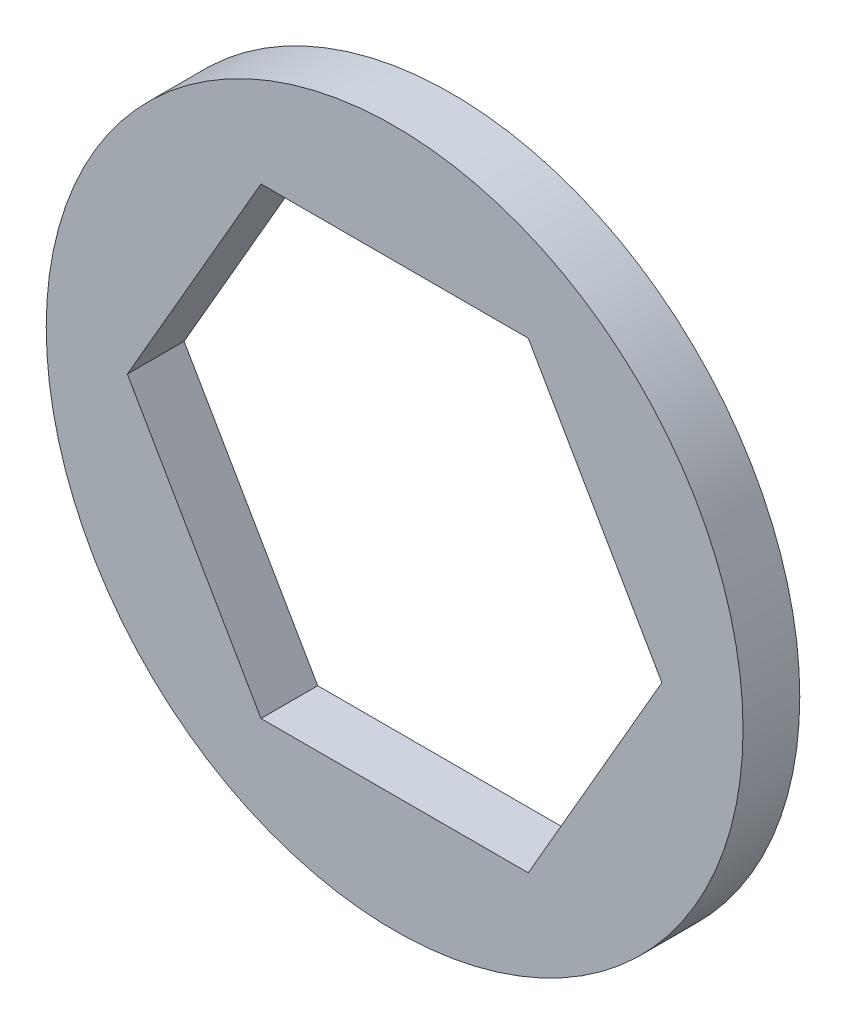
ISO-10303-21;
HEADER;
FILE_DESCRIPTION(('STEP AP214'),'2;1');
FILE_NAME('part.step','',(''),(''),'','','');
FILE_SCHEMA(('AUTOMOTIVE_DESIGN { 1 0 10303 214 1 1 1 1 }'));
ENDSEC;
DATA;
#1=APPLICATION_CONTEXT('core data for automotive mechanical design processes');
#2=APPLICATION_PROTOCOL_DEFINITION('international standard','automotive_design',2000,#1);
#3=PRODUCT_CONTEXT('',#1,'mechanical');
#4=PRODUCT('Part','Part','',(#3));
#5=PRODUCT_RELATED_PRODUCT_CATEGORY('part','',(#4));
#6=PRODUCT_DEFINITION_FORMATION('','',#4);
#7=PRODUCT_DEFINITION_CONTEXT('part definition',#1,'design');
#8=PRODUCT_DEFINITION('design','',#6,#7);
#9=PRODUCT_DEFINITION_SHAPE('','',#8);
#10=(LENGTH_UNIT() NAMED_UNIT(*) SI_UNIT(.MILLI.,.METRE.));
#11=(NAMED_UNIT(*) PLANE_ANGLE_UNIT() SI_UNIT($,.RADIAN.));
#12=(NAMED_UNIT(*) SI_UNIT($,.STERADIAN.) SOLID_ANGLE_UNIT());
#13=UNCERTAINTY_MEASURE_WITH_UNIT(LENGTH_MEASURE(1.E-05),#10,'distance_accuracy_value','');
#14=(GEOMETRIC_REPRESENTATION_CONTEXT(3) GLOBAL_UNCERTAINTY_ASSIGNED_CONTEXT((#13)) GLOBAL_UNIT_ASSIGNED_CONTEXT((#10,
#11,#12)) REPRESENTATION_CONTEXT('',''));
#15=CARTESIAN_POINT('',(0.,0.,0.));
#16=DIRECTION('',(0.,0.,1.));
#17=DIRECTION('',(1.,0.,0.));
#18=AXIS2_PLACEMENT_3D('',#15,#16,#17);
#19=CARTESIAN_POINT('',(0.,0.,0.79375));
#20=DIRECTION('',(0.,0.,1.));
#21=DIRECTION('',(1.,0.,0.));
#22=AXIS2_PLACEMENT_3D('',#19,#20,#21);
#23=PLANE('',#22);
#24=DIRECTION('',(1.,0.,0.));
#25=VECTOR('',#24,1.);
#26=CARTESIAN_POINT('',(3.7394976935412,6.477,0.79375));
#27=LINE('',#26,#25);
#28=CARTESIAN_POINT('',(3.7394976935412,6.477,0.79375));
#29=VERTEX_POINT('',#28);
#30=CARTESIAN_POINT('',(-3.73949769354121,6.477,0.79375));
#31=VERTEX_POINT('',#30);
#32=EDGE_CURVE('E64',#29,#31,#27,.F.);
#33=ORIENTED_EDGE('',*,*,#32,.F.);
#34=DIRECTION('',(0.5,-0.866025403784439,0.));
#35=VECTOR('',#34,1.);
#36=CARTESIAN_POINT('',(7.47899538708241,0.,0.79375));
#37=LINE('',#36,#35);
#38=CARTESIAN_POINT('',(7.47899538708242,0.,0.79375));
#39=VERTEX_POINT('',#38);
#40=EDGE_CURVE('E112',#39,#29,#37,.F.);
#41=ORIENTED_EDGE('',*,*,#40,.F.);
#42=DIRECTION('',(-0.5,-0.866025403784439,0.));
#43=VECTOR('',#42,1.);
#44=CARTESIAN_POINT('',(3.73949769354121,-6.477,0.79375));
#45=LINE('',#44,#43);
#46=CARTESIAN_POINT('',(3.73949769354121,-6.477,0.79375));
#47=VERTEX_POINT('',#46);
#48=EDGE_CURVE('E108',#47,#39,#45,.F.);
#49=ORIENTED_EDGE('',*,*,#48,.F.);
#50=DIRECTION('',(1.,0.,0.));
#51=VECTOR('',#50,1.);
#52=CARTESIAN_POINT('',(-3.73949769354121,-6.477,0.79375));
#53=LINE('',#52,#51);
#54=CARTESIAN_POINT('',(-3.73949769354121,-6.477,0.79375));
#55=VERTEX_POINT('',#54);
#56=EDGE_CURVE('E83',#55,#47,#53,.T.);
#57=ORIENTED_EDGE('',*,*,#56,.F.);
#58=DIRECTION('',(-0.5,0.866025403784439,0.));
#59=VECTOR('',#58,1.);
#60=CARTESIAN_POINT('',(-7.47899538708241,0.,0.79375));
#61=LINE('',#60,#59);
#62=CARTESIAN_POINT('',(-7.47899538708241,0.,0.79375));
#63=VERTEX_POINT('',#62);
#64=EDGE_CURVE('E78',#63,#55,#61,.F.);
#65=ORIENTED_EDGE('',*,*,#64,.F.);
#66=DIRECTION('',(0.5,0.866025403784439,0.));
#67=VECTOR('',#66,1.);
#68=CARTESIAN_POINT('',(-3.73949769354121,6.477,0.79375));
#69=LINE('',#68,#67);
#70=EDGE_CURVE('E69',#31,#63,#69,.F.);
#71=ORIENTED_EDGE('',*,*,#70,.F.);
#72=EDGE_LOOP('',(#33,#41,#49,#57,#65,#71));
#73=FACE_BOUND('',#72,.T.);
#74=CARTESIAN_POINT('',(0.,0.,0.79375));
#75=DIRECTION('',(0.,0.,-1.));
#76=DIRECTION('',(-1.,0.,0.));
#77=AXIS2_PLACEMENT_3D('',#74,#75,#76);
#78=CIRCLE('',#77,9.75);
#79=CARTESIAN_POINT('',(-9.75,0.,0.79375));
#80=VERTEX_POINT('',#79);
#81=EDGE_CURVE('E18',#80,#80,#78,.T.);
#82=ORIENTED_EDGE('',*,*,#81,.F.);
#83=EDGE_LOOP('',(#82));
#84=FACE_BOUND('',#83,.T.);
#85=ADVANCED_FACE('F15',(#73,#84),#23,.T.);
#86=CARTESIAN_POINT('',(0.,0.,0.79375));
#87=DIRECTION('',(0.,0.,-1.));
#88=DIRECTION('',(-1.,0.,0.));
#89=AXIS2_PLACEMENT_3D('',#86,#87,#88);
#90=CYLINDRICAL_SURFACE('',#89,9.75);
#91=ORIENTED_EDGE('',*,*,#81,.T.);
#92=EDGE_LOOP('',(#91));
#93=FACE_BOUND('',#92,.T.);
#94=CARTESIAN_POINT('',(0.,0.,-0.79375));
#95=DIRECTION('',(0.,0.,-1.));
#96=DIRECTION('',(-1.,0.,0.));
#97=AXIS2_PLACEMENT_3D('',#94,#95,#96);
#98=CIRCLE('',#97,9.75);
#99=CARTESIAN_POINT('',(-9.75,0.,-0.79375));
#100=VERTEX_POINT('',#99);
#101=EDGE_CURVE('E94',#100,#100,#98,.F.);
#102=ORIENTED_EDGE('',*,*,#101,.T.);
#103=EDGE_LOOP('',(#102));
#104=FACE_BOUND('',#103,.T.);
#105=ADVANCED_FACE('F183',(#93,#104),#90,.T.);
#106=CARTESIAN_POINT('',(-7.47899538708241,0.,0.79375));
#107=DIRECTION('',(0.866025403784439,0.5,0.));
#108=DIRECTION('',(-0.5,0.866025403784439,0.));
#109=AXIS2_PLACEMENT_3D('',#106,#107,#108);
#110=PLANE('',#109);
#111=ORIENTED_EDGE('',*,*,#64,.T.);
#112=DIRECTION('',(0.,0.,1.));
#113=VECTOR('',#112,1.);
#114=CARTESIAN_POINT('',(-3.73949769354121,-6.477,0.79375));
#115=LINE('',#114,#113);
#116=CARTESIAN_POINT('',(-3.73949769354121,-6.477,-0.79375));
#117=VERTEX_POINT('',#116);
#118=EDGE_CURVE('E101',#117,#55,#115,.T.);
#119=ORIENTED_EDGE('',*,*,#118,.F.);
#120=DIRECTION('',(-0.5,0.866025403784439,0.));
#121=VECTOR('',#120,1.);
#122=CARTESIAN_POINT('',(-3.73949769354121,-6.477,-0.79375));
#123=LINE('',#122,#121);
#124=CARTESIAN_POINT('',(-7.47899538708241,0.,-0.79375));
#125=VERTEX_POINT('',#124);
#126=EDGE_CURVE('E90',#117,#125,#123,.T.);
#127=ORIENTED_EDGE('',*,*,#126,.T.);
#128=DIRECTION('',(0.,0.,1.));
#129=VECTOR('',#128,1.);
#130=CARTESIAN_POINT('',(-7.47899538708241,0.,0.79375));
#131=LINE('',#130,#129);
#132=EDGE_CURVE('E74',#63,#125,#131,.F.);
#133=ORIENTED_EDGE('',*,*,#132,.F.);
#134=EDGE_LOOP('',(#111,#119,#127,#133));
#135=FACE_BOUND('',#134,.T.);
#136=ADVANCED_FACE('F89',(#135),#110,.T.);
#137=CARTESIAN_POINT('',(-3.73949769354121,6.477,0.79375));
#138=DIRECTION('',(0.866025403784439,-0.5,0.));
#139=DIRECTION('',(0.5,0.866025403784439,0.));
#140=AXIS2_PLACEMENT_3D('',#137,#138,#139);
#141=PLANE('',#140);
#142=ORIENTED_EDGE('',*,*,#70,.T.);
#143=ORIENTED_EDGE('',*,*,#132,.T.);
#144=DIRECTION('',(0.5,0.866025403784439,0.));
#145=VECTOR('',#144,1.);
#146=CARTESIAN_POINT('',(-7.47899538708241,0.,-0.79375));
#147=LINE('',#146,#145);
#148=CARTESIAN_POINT('',(-3.73949769354121,6.477,-0.79375));
#149=VERTEX_POINT('',#148);
#150=EDGE_CURVE('E98',#125,#149,#147,.T.);
#151=ORIENTED_EDGE('',*,*,#150,.T.);
#152=DIRECTION('',(0.,0.,1.));
#153=VECTOR('',#152,1.);
#154=CARTESIAN_POINT('',(-3.73949769354121,6.477,0.79375));
#155=LINE('',#154,#153);
#156=EDGE_CURVE('E76',#31,#149,#155,.F.);
#157=ORIENTED_EDGE('',*,*,#156,.F.);
#158=EDGE_LOOP('',(#142,#143,#151,#157));
#159=FACE_BOUND('',#158,.T.);
#160=ADVANCED_FACE('F71',(#159),#141,.T.);
#161=CARTESIAN_POINT('',(3.7394976935412,6.477,0.79375));
#162=DIRECTION('',(0.,-1.,0.));
#163=DIRECTION('',(1.,0.,0.));
#164=AXIS2_PLACEMENT_3D('',#161,#162,#163);
#165=PLANE('',#164);
#166=ORIENTED_EDGE('',*,*,#32,.T.);
#167=ORIENTED_EDGE('',*,*,#156,.T.);
#168=DIRECTION('',(1.,0.,0.));
#169=VECTOR('',#168,1.);
#170=CARTESIAN_POINT('',(0.,6.477,-0.79375));
#171=LINE('',#170,#169);
#172=CARTESIAN_POINT('',(3.7394976935412,6.477,-0.79375));
#173=VERTEX_POINT('',#172);
#174=EDGE_CURVE('E116',#149,#173,#171,.T.);
#175=ORIENTED_EDGE('',*,*,#174,.T.);
#176=DIRECTION('',(0.,0.,1.));
#177=VECTOR('',#176,1.);
#178=CARTESIAN_POINT('',(3.7394976935412,6.47700000000001,0.79375));
#179=LINE('',#178,#177);
#180=EDGE_CURVE('E110',#29,#173,#179,.F.);
#181=ORIENTED_EDGE('',*,*,#180,.F.);
#182=EDGE_LOOP('',(#166,#167,#175,#181));
#183=FACE_BOUND('',#182,.T.);
#184=ADVANCED_FACE('F115',(#183),#165,.T.);
#185=CARTESIAN_POINT('',(7.47899538708241,0.,0.79375));
#186=DIRECTION('',(-0.866025403784439,-0.5,0.));
#187=DIRECTION('',(0.5,-0.866025403784439,0.));
#188=AXIS2_PLACEMENT_3D('',#185,#186,#187);
#189=PLANE('',#188);
#190=ORIENTED_EDGE('',*,*,#40,.T.);
#191=ORIENTED_EDGE('',*,*,#180,.T.);
#192=DIRECTION('',(0.5,-0.866025403784438,0.));
#193=VECTOR('',#192,1.);
#194=CARTESIAN_POINT('',(3.7394976935412,6.477,-0.79375));
#195=LINE('',#194,#193);
#196=CARTESIAN_POINT('',(7.47899538708241,0.,-0.79375));
#197=VERTEX_POINT('',#196);
#198=EDGE_CURVE('E123',#173,#197,#195,.T.);
#199=ORIENTED_EDGE('',*,*,#198,.T.);
#200=DIRECTION('',(0.,0.,1.));
#201=VECTOR('',#200,1.);
#202=CARTESIAN_POINT('',(7.47899538708242,0.,0.79375));
#203=LINE('',#202,#201);
#204=EDGE_CURVE('E106',#39,#197,#203,.F.);
#205=ORIENTED_EDGE('',*,*,#204,.F.);
#206=EDGE_LOOP('',(#190,#191,#199,#205));
#207=FACE_BOUND('',#206,.T.);
#208=ADVANCED_FACE('F132',(#207),#189,.T.);
#209=CARTESIAN_POINT('',(3.73949769354121,-6.477,0.79375));
#210=DIRECTION('',(-0.866025403784439,0.5,0.));
#211=DIRECTION('',(-0.5,-0.866025403784439,0.));
#212=AXIS2_PLACEMENT_3D('',#209,#210,#211);
#213=PLANE('',#212);
#214=ORIENTED_EDGE('',*,*,#48,.T.);
#215=ORIENTED_EDGE('',*,*,#204,.T.);
#216=DIRECTION('',(-0.5,-0.866025403784439,0.));
#217=VECTOR('',#216,1.);
#218=CARTESIAN_POINT('',(7.47899538708241,0.,-0.79375));
#219=LINE('',#218,#217);
#220=CARTESIAN_POINT('',(3.73949769354121,-6.477,-0.79375));
#221=VERTEX_POINT('',#220);
#222=EDGE_CURVE('E24',#197,#221,#219,.T.);
#223=ORIENTED_EDGE('',*,*,#222,.T.);
#224=DIRECTION('',(0.,0.,1.));
#225=VECTOR('',#224,1.);
#226=CARTESIAN_POINT('',(3.73949769354121,-6.477,0.79375));
#227=LINE('',#226,#225);
#228=EDGE_CURVE('E32',#47,#221,#227,.F.);
#229=ORIENTED_EDGE('',*,*,#228,.F.);
#230=EDGE_LOOP('',(#214,#215,#223,#229));
#231=FACE_BOUND('',#230,.T.);
#232=ADVANCED_FACE('F129',(#231),#213,.T.);
#233=CARTESIAN_POINT('',(-3.73949769354121,-6.477,0.79375));
#234=DIRECTION('',(0.,1.,0.));
#235=DIRECTION('',(0.,0.,1.));
#236=AXIS2_PLACEMENT_3D('',#233,#234,#235);
#237=PLANE('',#236);
#238=ORIENTED_EDGE('',*,*,#56,.T.);
#239=ORIENTED_EDGE('',*,*,#228,.T.);
#240=DIRECTION('',(1.,0.,0.));
#241=VECTOR('',#240,1.);
#242=CARTESIAN_POINT('',(0.,-6.477,-0.79375));
#243=LINE('',#242,#241);
#244=EDGE_CURVE('E9',#221,#117,#243,.F.);
#245=ORIENTED_EDGE('',*,*,#244,.T.);
#246=ORIENTED_EDGE('',*,*,#118,.T.);
#247=EDGE_LOOP('',(#238,#239,#245,#246));
#248=FACE_BOUND('',#247,.T.);
#249=ADVANCED_FACE('F141',(#248),#237,.T.);
#250=CARTESIAN_POINT('',(0.,0.,-0.79375));
#251=DIRECTION('',(0.,0.,1.));
#252=DIRECTION('',(1.,0.,0.));
#253=AXIS2_PLACEMENT_3D('',#250,#251,#252);
#254=PLANE('',#253);
#255=ORIENTED_EDGE('',*,*,#222,.F.);
#256=ORIENTED_EDGE('',*,*,#198,.F.);
#257=ORIENTED_EDGE('',*,*,#174,.F.);
#258=ORIENTED_EDGE('',*,*,#150,.F.);
#259=ORIENTED_EDGE('',*,*,#126,.F.);
#260=ORIENTED_EDGE('',*,*,#244,.F.);
#261=EDGE_LOOP('',(#255,#256,#257,#258,#259,#260));
#262=FACE_BOUND('',#261,.T.);
#263=ORIENTED_EDGE('',*,*,#101,.F.);
#264=EDGE_LOOP('',(#263));
#265=FACE_BOUND('',#264,.T.);
#266=ADVANCED_FACE('F120',(#262,#265),#254,.F.);
#267=CLOSED_SHELL('',(#85,#105,#136,#160,#184,#208,#232,#249,#266));
#268=MANIFOLD_SOLID_BREP('B1',#267);
#269=ADVANCED_BREP_SHAPE_REPRESENTATION('',(#18,#268),#14);
#270=SHAPE_DEFINITION_REPRESENTATION(#9,#269);
ENDSEC;
END-ISO-10303-21;
